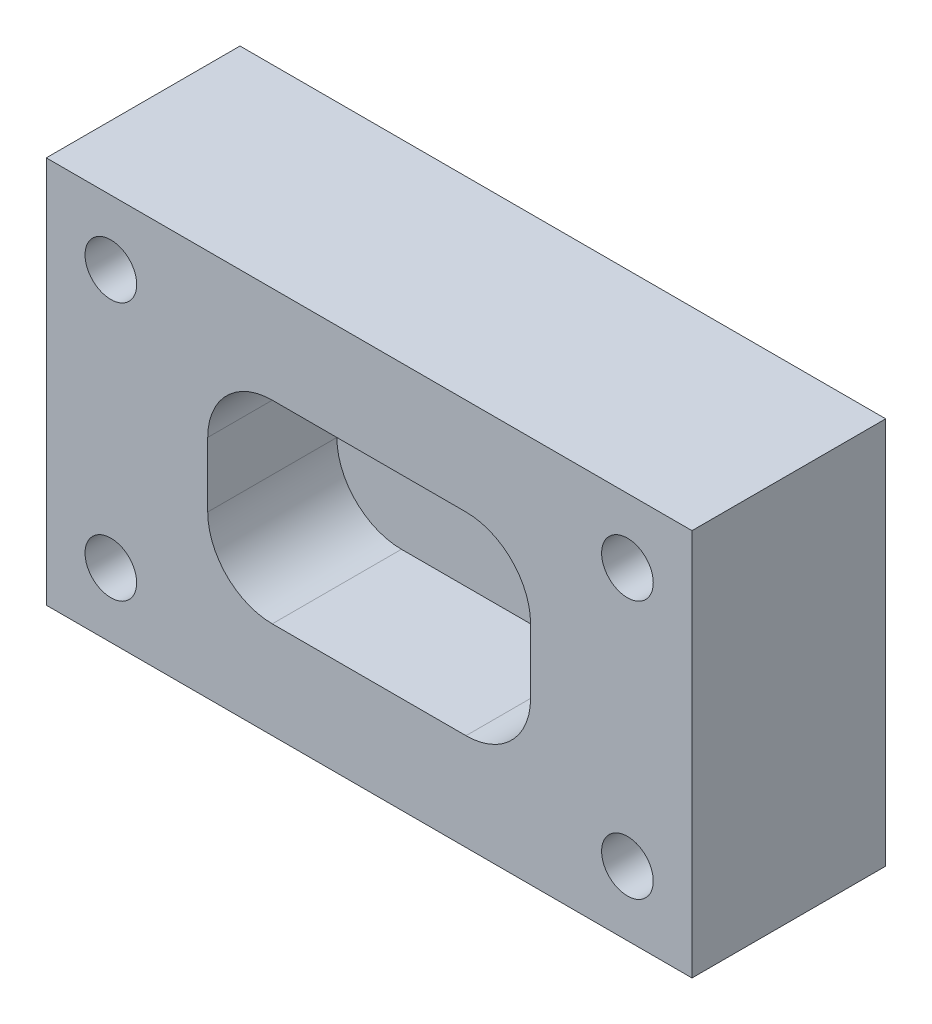
ISO-10303-21;
HEADER;
FILE_DESCRIPTION(('STEP AP214'),'2;1');
FILE_NAME('part.step','',(''),(''),'','','');
FILE_SCHEMA(('AUTOMOTIVE_DESIGN { 1 0 10303 214 1 1 1 1 }'));
ENDSEC;
DATA;
#1=APPLICATION_CONTEXT('core data for automotive mechanical design processes');
#2=APPLICATION_PROTOCOL_DEFINITION('international standard','automotive_design',2000,#1);
#3=PRODUCT_CONTEXT('',#1,'mechanical');
#4=PRODUCT('Part','Part','',(#3));
#5=PRODUCT_RELATED_PRODUCT_CATEGORY('part','',(#4));
#6=PRODUCT_DEFINITION_FORMATION('','',#4);
#7=PRODUCT_DEFINITION_CONTEXT('part definition',#1,'design');
#8=PRODUCT_DEFINITION('design','',#6,#7);
#9=PRODUCT_DEFINITION_SHAPE('','',#8);
#10=(LENGTH_UNIT() NAMED_UNIT(*) SI_UNIT(.MILLI.,.METRE.));
#11=(NAMED_UNIT(*) PLANE_ANGLE_UNIT() SI_UNIT($,.RADIAN.));
#12=(NAMED_UNIT(*) SI_UNIT($,.STERADIAN.) SOLID_ANGLE_UNIT());
#13=UNCERTAINTY_MEASURE_WITH_UNIT(LENGTH_MEASURE(1.E-05),#10,'distance_accuracy_value','');
#14=(GEOMETRIC_REPRESENTATION_CONTEXT(3) GLOBAL_UNCERTAINTY_ASSIGNED_CONTEXT((#13)) GLOBAL_UNIT_ASSIGNED_CONTEXT((#10,
#11,#12)) REPRESENTATION_CONTEXT('',''));
#15=CARTESIAN_POINT('',(0.,0.,0.));
#16=DIRECTION('',(0.,0.,1.));
#17=DIRECTION('',(1.,0.,0.));
#18=AXIS2_PLACEMENT_3D('',#15,#16,#17);
#19=CARTESIAN_POINT('',(50.,0.,-30.));
#20=DIRECTION('',(0.,-1.,0.));
#21=DIRECTION('',(0.,0.,-1.));
#22=AXIS2_PLACEMENT_3D('',#19,#20,#21);
#23=PLANE('',#22);
#24=DIRECTION('',(1.,0.,0.));
#25=VECTOR('',#24,1.);
#26=CARTESIAN_POINT('',(50.,0.,0.));
#27=LINE('',#26,#25);
#28=CARTESIAN_POINT('',(0.,0.,0.));
#29=VERTEX_POINT('',#28);
#30=CARTESIAN_POINT('',(100.,0.,0.));
#31=VERTEX_POINT('',#30);
#32=EDGE_CURVE('E231',#29,#31,#27,.T.);
#33=ORIENTED_EDGE('',*,*,#32,.F.);
#34=DIRECTION('',(0.,0.,1.));
#35=VECTOR('',#34,1.);
#36=CARTESIAN_POINT('',(0.,0.,-30.));
#37=LINE('',#36,#35);
#38=CARTESIAN_POINT('',(0.,0.,-30.));
#39=VERTEX_POINT('',#38);
#40=EDGE_CURVE('E11',#39,#29,#37,.T.);
#41=ORIENTED_EDGE('',*,*,#40,.F.);
#42=DIRECTION('',(1.,0.,0.));
#43=VECTOR('',#42,1.);
#44=CARTESIAN_POINT('',(50.,0.,-30.));
#45=LINE('',#44,#43);
#46=CARTESIAN_POINT('',(100.,0.,-30.));
#47=VERTEX_POINT('',#46);
#48=EDGE_CURVE('E211',#39,#47,#45,.T.);
#49=ORIENTED_EDGE('',*,*,#48,.T.);
#50=DIRECTION('',(0.,0.,1.));
#51=VECTOR('',#50,1.);
#52=CARTESIAN_POINT('',(100.,0.,-30.));
#53=LINE('',#52,#51);
#54=EDGE_CURVE('E35',#47,#31,#53,.T.);
#55=ORIENTED_EDGE('',*,*,#54,.T.);
#56=EDGE_LOOP('',(#33,#41,#49,#55));
#57=FACE_BOUND('',#56,.T.);
#58=ADVANCED_FACE('F31',(#57),#23,.T.);
#59=CARTESIAN_POINT('',(0.,-60.8497451198258,-30.));
#60=DIRECTION('',(1.,0.,0.));
#61=DIRECTION('',(0.,0.,-1.));
#62=AXIS2_PLACEMENT_3D('',#59,#60,#61);
#63=PLANE('',#62);
#64=DIRECTION('',(0.,1.,0.));
#65=VECTOR('',#64,1.);
#66=CARTESIAN_POINT('',(0.,-60.8497451198258,0.));
#67=LINE('',#66,#65);
#68=CARTESIAN_POINT('',(0.,60.,0.));
#69=VERTEX_POINT('',#68);
#70=EDGE_CURVE('E202',#29,#69,#67,.T.);
#71=ORIENTED_EDGE('',*,*,#70,.T.);
#72=DIRECTION('',(0.,0.,1.));
#73=VECTOR('',#72,1.);
#74=CARTESIAN_POINT('',(0.,60.,-30.));
#75=LINE('',#74,#73);
#76=CARTESIAN_POINT('',(0.,60.,-30.));
#77=VERTEX_POINT('',#76);
#78=EDGE_CURVE('E40',#77,#69,#75,.T.);
#79=ORIENTED_EDGE('',*,*,#78,.F.);
#80=DIRECTION('',(0.,1.,0.));
#81=VECTOR('',#80,1.);
#82=CARTESIAN_POINT('',(0.,-60.8497451198258,-30.));
#83=LINE('',#82,#81);
#84=EDGE_CURVE('E217',#39,#77,#83,.T.);
#85=ORIENTED_EDGE('',*,*,#84,.F.);
#86=ORIENTED_EDGE('',*,*,#40,.T.);
#87=EDGE_LOOP('',(#71,#79,#85,#86));
#88=FACE_BOUND('',#87,.T.);
#89=ADVANCED_FACE('F249',(#88),#63,.F.);
#90=CARTESIAN_POINT('',(50.,60.,-30.));
#91=DIRECTION('',(0.,-1.,0.));
#92=DIRECTION('',(0.,0.,-1.));
#93=AXIS2_PLACEMENT_3D('',#90,#91,#92);
#94=PLANE('',#93);
#95=DIRECTION('',(1.,0.,0.));
#96=VECTOR('',#95,1.);
#97=CARTESIAN_POINT('',(50.,60.,0.));
#98=LINE('',#97,#96);
#99=CARTESIAN_POINT('',(100.,60.,0.));
#100=VERTEX_POINT('',#99);
#101=EDGE_CURVE('E237',#69,#100,#98,.T.);
#102=ORIENTED_EDGE('',*,*,#101,.T.);
#103=DIRECTION('',(0.,0.,1.));
#104=VECTOR('',#103,1.);
#105=CARTESIAN_POINT('',(100.,60.,-30.));
#106=LINE('',#105,#104);
#107=CARTESIAN_POINT('',(100.,60.,-30.));
#108=VERTEX_POINT('',#107);
#109=EDGE_CURVE('E242',#108,#100,#106,.T.);
#110=ORIENTED_EDGE('',*,*,#109,.F.);
#111=DIRECTION('',(1.,0.,0.));
#112=VECTOR('',#111,1.);
#113=CARTESIAN_POINT('',(50.,60.,-30.));
#114=LINE('',#113,#112);
#115=EDGE_CURVE('E215',#77,#108,#114,.T.);
#116=ORIENTED_EDGE('',*,*,#115,.F.);
#117=ORIENTED_EDGE('',*,*,#78,.T.);
#118=EDGE_LOOP('',(#102,#110,#116,#117));
#119=FACE_BOUND('',#118,.T.);
#120=ADVANCED_FACE('F251',(#119),#94,.F.);
#121=CARTESIAN_POINT('',(90.,50.,-30.));
#122=DIRECTION('',(0.,0.,1.));
#123=DIRECTION('',(1.,0.,0.));
#124=AXIS2_PLACEMENT_3D('',#121,#122,#123);
#125=CYLINDRICAL_SURFACE('',#124,4.00000000000001);
#126=CARTESIAN_POINT('',(90.,50.,-30.));
#127=DIRECTION('',(0.,0.,1.));
#128=DIRECTION('',(1.,0.,0.));
#129=AXIS2_PLACEMENT_3D('',#126,#127,#128);
#130=CIRCLE('',#129,4.00000000000001);
#131=CARTESIAN_POINT('',(94.,50.,-30.));
#132=VERTEX_POINT('',#131);
#133=EDGE_CURVE('E208',#132,#132,#130,.T.);
#134=ORIENTED_EDGE('',*,*,#133,.F.);
#135=EDGE_LOOP('',(#134));
#136=FACE_BOUND('',#135,.T.);
#137=CARTESIAN_POINT('',(90.,50.,0.));
#138=DIRECTION('',(0.,0.,1.));
#139=DIRECTION('',(1.,0.,0.));
#140=AXIS2_PLACEMENT_3D('',#137,#138,#139);
#141=CIRCLE('',#140,4.00000000000001);
#142=CARTESIAN_POINT('',(94.,50.,0.));
#143=VERTEX_POINT('',#142);
#144=EDGE_CURVE('E228',#143,#143,#141,.T.);
#145=ORIENTED_EDGE('',*,*,#144,.T.);
#146=EDGE_LOOP('',(#145));
#147=FACE_BOUND('',#146,.T.);
#148=ADVANCED_FACE('F274',(#136,#147),#125,.F.);
#149=CARTESIAN_POINT('',(10.,50.,-30.));
#150=DIRECTION('',(0.,0.,1.));
#151=DIRECTION('',(1.,0.,0.));
#152=AXIS2_PLACEMENT_3D('',#149,#150,#151);
#153=CYLINDRICAL_SURFACE('',#152,4.00000000000001);
#154=CARTESIAN_POINT('',(10.,50.,-30.));
#155=DIRECTION('',(0.,0.,1.));
#156=DIRECTION('',(1.,0.,0.));
#157=AXIS2_PLACEMENT_3D('',#154,#155,#156);
#158=CIRCLE('',#157,4.00000000000001);
#159=CARTESIAN_POINT('',(14.,50.,-30.));
#160=VERTEX_POINT('',#159);
#161=EDGE_CURVE('E205',#160,#160,#158,.T.);
#162=ORIENTED_EDGE('',*,*,#161,.F.);
#163=EDGE_LOOP('',(#162));
#164=FACE_BOUND('',#163,.T.);
#165=CARTESIAN_POINT('',(10.,50.,0.));
#166=DIRECTION('',(0.,0.,1.));
#167=DIRECTION('',(1.,0.,0.));
#168=AXIS2_PLACEMENT_3D('',#165,#166,#167);
#169=CIRCLE('',#168,4.00000000000001);
#170=CARTESIAN_POINT('',(14.,50.,0.));
#171=VERTEX_POINT('',#170);
#172=EDGE_CURVE('E225',#171,#171,#169,.T.);
#173=ORIENTED_EDGE('',*,*,#172,.T.);
#174=EDGE_LOOP('',(#173));
#175=FACE_BOUND('',#174,.T.);
#176=ADVANCED_FACE('F277',(#164,#175),#153,.F.);
#177=CARTESIAN_POINT('',(9.99999999999999,10.,-30.));
#178=DIRECTION('',(0.,0.,1.));
#179=DIRECTION('',(1.,0.,0.));
#180=AXIS2_PLACEMENT_3D('',#177,#178,#179);
#181=CYLINDRICAL_SURFACE('',#180,4.);
#182=CARTESIAN_POINT('',(9.99999999999999,10.,-30.));
#183=DIRECTION('',(0.,0.,1.));
#184=DIRECTION('',(1.,0.,0.));
#185=AXIS2_PLACEMENT_3D('',#182,#183,#184);
#186=CIRCLE('',#185,4.);
#187=CARTESIAN_POINT('',(14.,10.,-30.));
#188=VERTEX_POINT('',#187);
#189=EDGE_CURVE('E201',#188,#188,#186,.T.);
#190=ORIENTED_EDGE('',*,*,#189,.F.);
#191=EDGE_LOOP('',(#190));
#192=FACE_BOUND('',#191,.T.);
#193=CARTESIAN_POINT('',(9.99999999999999,10.,0.));
#194=DIRECTION('',(0.,0.,1.));
#195=DIRECTION('',(1.,0.,0.));
#196=AXIS2_PLACEMENT_3D('',#193,#194,#195);
#197=CIRCLE('',#196,4.);
#198=CARTESIAN_POINT('',(14.,10.,0.));
#199=VERTEX_POINT('',#198);
#200=EDGE_CURVE('E222',#199,#199,#197,.T.);
#201=ORIENTED_EDGE('',*,*,#200,.T.);
#202=EDGE_LOOP('',(#201));
#203=FACE_BOUND('',#202,.T.);
#204=ADVANCED_FACE('F280',(#192,#203),#181,.F.);
#205=CARTESIAN_POINT('',(90.,10.,-30.));
#206=DIRECTION('',(0.,0.,1.));
#207=DIRECTION('',(1.,0.,0.));
#208=AXIS2_PLACEMENT_3D('',#205,#206,#207);
#209=CYLINDRICAL_SURFACE('',#208,4.00000000000001);
#210=CARTESIAN_POINT('',(90.,10.,-30.));
#211=DIRECTION('',(0.,0.,1.));
#212=DIRECTION('',(1.,0.,0.));
#213=AXIS2_PLACEMENT_3D('',#210,#211,#212);
#214=CIRCLE('',#213,4.00000000000001);
#215=CARTESIAN_POINT('',(94.,10.,-30.));
#216=VERTEX_POINT('',#215);
#217=EDGE_CURVE('E198',#216,#216,#214,.T.);
#218=ORIENTED_EDGE('',*,*,#217,.F.);
#219=EDGE_LOOP('',(#218));
#220=FACE_BOUND('',#219,.T.);
#221=CARTESIAN_POINT('',(90.,10.,0.));
#222=DIRECTION('',(0.,0.,1.));
#223=DIRECTION('',(1.,0.,0.));
#224=AXIS2_PLACEMENT_3D('',#221,#222,#223);
#225=CIRCLE('',#224,4.00000000000001);
#226=CARTESIAN_POINT('',(94.,10.,0.));
#227=VERTEX_POINT('',#226);
#228=EDGE_CURVE('E186',#227,#227,#225,.T.);
#229=ORIENTED_EDGE('',*,*,#228,.T.);
#230=EDGE_LOOP('',(#229));
#231=FACE_BOUND('',#230,.T.);
#232=ADVANCED_FACE('F33',(#220,#231),#209,.F.);
#233=CARTESIAN_POINT('',(100.,-60.8497451198258,-30.));
#234=DIRECTION('',(1.,0.,0.));
#235=DIRECTION('',(0.,0.,-1.));
#236=AXIS2_PLACEMENT_3D('',#233,#234,#235);
#237=PLANE('',#236);
#238=DIRECTION('',(0.,1.,0.));
#239=VECTOR('',#238,1.);
#240=CARTESIAN_POINT('',(100.,-60.8497451198258,0.));
#241=LINE('',#240,#239);
#242=EDGE_CURVE('E234',#31,#100,#241,.T.);
#243=ORIENTED_EDGE('',*,*,#242,.F.);
#244=ORIENTED_EDGE('',*,*,#54,.F.);
#245=DIRECTION('',(0.,1.,0.));
#246=VECTOR('',#245,1.);
#247=CARTESIAN_POINT('',(100.,-60.8497451198258,-30.));
#248=LINE('',#247,#246);
#249=EDGE_CURVE('E213',#47,#108,#248,.T.);
#250=ORIENTED_EDGE('',*,*,#249,.T.);
#251=ORIENTED_EDGE('',*,*,#109,.T.);
#252=EDGE_LOOP('',(#243,#244,#250,#251));
#253=FACE_BOUND('',#252,.T.);
#254=ADVANCED_FACE('F245',(#253),#237,.T.);
#255=CARTESIAN_POINT('',(50.,-60.8497451198258,-30.));
#256=DIRECTION('',(0.,0.,1.));
#257=DIRECTION('',(1.,0.,0.));
#258=AXIS2_PLACEMENT_3D('',#255,#256,#257);
#259=PLANE('',#258);
#260=ORIENTED_EDGE('',*,*,#217,.T.);
#261=EDGE_LOOP('',(#260));
#262=FACE_BOUND('',#261,.T.);
#263=ORIENTED_EDGE('',*,*,#189,.T.);
#264=EDGE_LOOP('',(#263));
#265=FACE_BOUND('',#264,.T.);
#266=ORIENTED_EDGE('',*,*,#161,.T.);
#267=EDGE_LOOP('',(#266));
#268=FACE_BOUND('',#267,.T.);
#269=ORIENTED_EDGE('',*,*,#133,.T.);
#270=EDGE_LOOP('',(#269));
#271=FACE_BOUND('',#270,.T.);
#272=ORIENTED_EDGE('',*,*,#48,.F.);
#273=ORIENTED_EDGE('',*,*,#84,.T.);
#274=ORIENTED_EDGE('',*,*,#115,.T.);
#275=ORIENTED_EDGE('',*,*,#249,.F.);
#276=EDGE_LOOP('',(#272,#273,#274,#275));
#277=FACE_BOUND('',#276,.T.);
#278=ADVANCED_FACE('F253',(#262,#265,#268,#271,#277),#259,.F.);
#279=CARTESIAN_POINT('',(50.,-60.8497451198258,0.));
#280=DIRECTION('',(0.,0.,1.));
#281=DIRECTION('',(1.,0.,0.));
#282=AXIS2_PLACEMENT_3D('',#279,#280,#281);
#283=PLANE('',#282);
#284=DIRECTION('',(0.,-1.,0.));
#285=VECTOR('',#284,1.);
#286=CARTESIAN_POINT('',(25.,-60.8497451198258,0.));
#287=LINE('',#286,#285);
#288=CARTESIAN_POINT('',(25.,34.9999999999999,0.));
#289=VERTEX_POINT('',#288);
#290=CARTESIAN_POINT('',(25.,25.0000000000001,0.));
#291=VERTEX_POINT('',#290);
#292=EDGE_CURVE('E48',#289,#291,#287,.T.);
#293=ORIENTED_EDGE('',*,*,#292,.F.);
#294=CARTESIAN_POINT('',(35.,35.,0.));
#295=DIRECTION('',(0.,0.,1.));
#296=DIRECTION('',(1.,0.,0.));
#297=AXIS2_PLACEMENT_3D('',#294,#295,#296);
#298=CIRCLE('',#297,10.);
#299=CARTESIAN_POINT('',(35.0000000000001,45.,0.));
#300=VERTEX_POINT('',#299);
#301=EDGE_CURVE('E149',#300,#289,#298,.T.);
#302=ORIENTED_EDGE('',*,*,#301,.F.);
#303=DIRECTION('',(1.,0.,0.));
#304=VECTOR('',#303,1.);
#305=CARTESIAN_POINT('',(50.,45.,0.));
#306=LINE('',#305,#304);
#307=CARTESIAN_POINT('',(64.9999999999999,45.,0.));
#308=VERTEX_POINT('',#307);
#309=EDGE_CURVE('E152',#300,#308,#306,.T.);
#310=ORIENTED_EDGE('',*,*,#309,.T.);
#311=CARTESIAN_POINT('',(65.,35.,0.));
#312=DIRECTION('',(0.,0.,1.));
#313=DIRECTION('',(1.,0.,0.));
#314=AXIS2_PLACEMENT_3D('',#311,#312,#313);
#315=CIRCLE('',#314,10.);
#316=CARTESIAN_POINT('',(75.,34.9999999999999,0.));
#317=VERTEX_POINT('',#316);
#318=EDGE_CURVE('E179',#317,#308,#315,.T.);
#319=ORIENTED_EDGE('',*,*,#318,.F.);
#320=DIRECTION('',(0.,-1.,0.));
#321=VECTOR('',#320,1.);
#322=CARTESIAN_POINT('',(75.,-60.8497451198258,0.));
#323=LINE('',#322,#321);
#324=CARTESIAN_POINT('',(75.,25.0000000000001,0.));
#325=VERTEX_POINT('',#324);
#326=EDGE_CURVE('E176',#317,#325,#323,.T.);
#327=ORIENTED_EDGE('',*,*,#326,.T.);
#328=CARTESIAN_POINT('',(65.,25.,0.));
#329=DIRECTION('',(0.,0.,1.));
#330=DIRECTION('',(1.,0.,0.));
#331=AXIS2_PLACEMENT_3D('',#328,#329,#330);
#332=CIRCLE('',#331,10.);
#333=CARTESIAN_POINT('',(64.9999999999999,15.,0.));
#334=VERTEX_POINT('',#333);
#335=EDGE_CURVE('E173',#334,#325,#332,.T.);
#336=ORIENTED_EDGE('',*,*,#335,.F.);
#337=DIRECTION('',(1.,0.,0.));
#338=VECTOR('',#337,1.);
#339=CARTESIAN_POINT('',(50.,15.,0.));
#340=LINE('',#339,#338);
#341=CARTESIAN_POINT('',(35.0000000000001,15.,0.));
#342=VERTEX_POINT('',#341);
#343=EDGE_CURVE('E170',#342,#334,#340,.T.);
#344=ORIENTED_EDGE('',*,*,#343,.F.);
#345=CARTESIAN_POINT('',(35.,25.,0.));
#346=DIRECTION('',(0.,0.,1.));
#347=DIRECTION('',(1.,0.,0.));
#348=AXIS2_PLACEMENT_3D('',#345,#346,#347);
#349=CIRCLE('',#348,10.);
#350=EDGE_CURVE('E168',#291,#342,#349,.T.);
#351=ORIENTED_EDGE('',*,*,#350,.F.);
#352=EDGE_LOOP('',(#293,#302,#310,#319,#327,#336,#344,#351));
#353=FACE_BOUND('',#352,.T.);
#354=ORIENTED_EDGE('',*,*,#228,.F.);
#355=EDGE_LOOP('',(#354));
#356=FACE_BOUND('',#355,.T.);
#357=ORIENTED_EDGE('',*,*,#200,.F.);
#358=EDGE_LOOP('',(#357));
#359=FACE_BOUND('',#358,.T.);
#360=ORIENTED_EDGE('',*,*,#172,.F.);
#361=EDGE_LOOP('',(#360));
#362=FACE_BOUND('',#361,.T.);
#363=ORIENTED_EDGE('',*,*,#144,.F.);
#364=EDGE_LOOP('',(#363));
#365=FACE_BOUND('',#364,.T.);
#366=ORIENTED_EDGE('',*,*,#32,.T.);
#367=ORIENTED_EDGE('',*,*,#242,.T.);
#368=ORIENTED_EDGE('',*,*,#101,.F.);
#369=ORIENTED_EDGE('',*,*,#70,.F.);
#370=EDGE_LOOP('',(#366,#367,#368,#369));
#371=FACE_BOUND('',#370,.T.);
#372=ADVANCED_FACE('F247',(#353,#356,#359,#362,#365,#371),#283,.T.);
#373=CARTESIAN_POINT('',(25.,-60.8497451198258,-20.));
#374=DIRECTION('',(-1.,0.,0.));
#375=DIRECTION('',(0.,0.,1.));
#376=AXIS2_PLACEMENT_3D('',#373,#374,#375);
#377=PLANE('',#376);
#378=ORIENTED_EDGE('',*,*,#292,.T.);
#379=DIRECTION('',(0.,0.,1.));
#380=VECTOR('',#379,1.);
#381=CARTESIAN_POINT('',(25.,25.0000000000001,-20.));
#382=LINE('',#381,#380);
#383=CARTESIAN_POINT('',(25.,25.0000000000001,-20.));
#384=VERTEX_POINT('',#383);
#385=EDGE_CURVE('E126',#384,#291,#382,.T.);
#386=ORIENTED_EDGE('',*,*,#385,.F.);
#387=DIRECTION('',(0.,-1.,0.));
#388=VECTOR('',#387,1.);
#389=CARTESIAN_POINT('',(25.,-60.8497451198258,-20.));
#390=LINE('',#389,#388);
#391=CARTESIAN_POINT('',(25.,34.9999999999999,-20.));
#392=VERTEX_POINT('',#391);
#393=EDGE_CURVE('E130',#392,#384,#390,.T.);
#394=ORIENTED_EDGE('',*,*,#393,.F.);
#395=DIRECTION('',(0.,0.,1.));
#396=VECTOR('',#395,1.);
#397=CARTESIAN_POINT('',(25.,34.9999999999999,-20.));
#398=LINE('',#397,#396);
#399=EDGE_CURVE('E184',#392,#289,#398,.T.);
#400=ORIENTED_EDGE('',*,*,#399,.T.);
#401=EDGE_LOOP('',(#378,#386,#394,#400));
#402=FACE_BOUND('',#401,.T.);
#403=ADVANCED_FACE('F128',(#402),#377,.F.);
#404=CARTESIAN_POINT('',(35.,35.,-20.));
#405=DIRECTION('',(0.,0.,1.));
#406=DIRECTION('',(1.,0.,0.));
#407=AXIS2_PLACEMENT_3D('',#404,#405,#406);
#408=CYLINDRICAL_SURFACE('',#407,10.);
#409=ORIENTED_EDGE('',*,*,#301,.T.);
#410=ORIENTED_EDGE('',*,*,#399,.F.);
#411=CARTESIAN_POINT('',(35.,35.,-20.));
#412=DIRECTION('',(0.,0.,1.));
#413=DIRECTION('',(1.,0.,0.));
#414=AXIS2_PLACEMENT_3D('',#411,#412,#413);
#415=CIRCLE('',#414,10.);
#416=CARTESIAN_POINT('',(35.0000000000001,45.,-20.));
#417=VERTEX_POINT('',#416);
#418=EDGE_CURVE('E136',#417,#392,#415,.T.);
#419=ORIENTED_EDGE('',*,*,#418,.F.);
#420=DIRECTION('',(0.,0.,1.));
#421=VECTOR('',#420,1.);
#422=CARTESIAN_POINT('',(35.0000000000001,45.,-20.));
#423=LINE('',#422,#421);
#424=EDGE_CURVE('E187',#417,#300,#423,.T.);
#425=ORIENTED_EDGE('',*,*,#424,.T.);
#426=EDGE_LOOP('',(#409,#410,#419,#425));
#427=FACE_BOUND('',#426,.T.);
#428=ADVANCED_FACE('F331',(#427),#408,.F.);
#429=CARTESIAN_POINT('',(50.,45.,-20.));
#430=DIRECTION('',(0.,-1.,0.));
#431=DIRECTION('',(1.,0.,0.));
#432=AXIS2_PLACEMENT_3D('',#429,#430,#431);
#433=PLANE('',#432);
#434=ORIENTED_EDGE('',*,*,#309,.F.);
#435=ORIENTED_EDGE('',*,*,#424,.F.);
#436=DIRECTION('',(1.,0.,0.));
#437=VECTOR('',#436,1.);
#438=CARTESIAN_POINT('',(50.,45.,-20.));
#439=LINE('',#438,#437);
#440=CARTESIAN_POINT('',(64.9999999999999,45.,-20.));
#441=VERTEX_POINT('',#440);
#442=EDGE_CURVE('E164',#417,#441,#439,.T.);
#443=ORIENTED_EDGE('',*,*,#442,.T.);
#444=DIRECTION('',(0.,0.,1.));
#445=VECTOR('',#444,1.);
#446=CARTESIAN_POINT('',(64.9999999999999,45.,-20.));
#447=LINE('',#446,#445);
#448=EDGE_CURVE('E189',#441,#308,#447,.T.);
#449=ORIENTED_EDGE('',*,*,#448,.T.);
#450=EDGE_LOOP('',(#434,#435,#443,#449));
#451=FACE_BOUND('',#450,.T.);
#452=ADVANCED_FACE('F339',(#451),#433,.T.);
#453=CARTESIAN_POINT('',(65.,35.,-20.));
#454=DIRECTION('',(0.,0.,1.));
#455=DIRECTION('',(1.,0.,0.));
#456=AXIS2_PLACEMENT_3D('',#453,#454,#455);
#457=CYLINDRICAL_SURFACE('',#456,10.);
#458=ORIENTED_EDGE('',*,*,#318,.T.);
#459=ORIENTED_EDGE('',*,*,#448,.F.);
#460=CARTESIAN_POINT('',(65.,35.,-20.));
#461=DIRECTION('',(0.,0.,1.));
#462=DIRECTION('',(1.,0.,0.));
#463=AXIS2_PLACEMENT_3D('',#460,#461,#462);
#464=CIRCLE('',#463,10.);
#465=CARTESIAN_POINT('',(75.,34.9999999999999,-20.));
#466=VERTEX_POINT('',#465);
#467=EDGE_CURVE('E161',#466,#441,#464,.T.);
#468=ORIENTED_EDGE('',*,*,#467,.F.);
#469=DIRECTION('',(0.,0.,1.));
#470=VECTOR('',#469,1.);
#471=CARTESIAN_POINT('',(75.,34.9999999999999,-20.));
#472=LINE('',#471,#470);
#473=EDGE_CURVE('E191',#466,#317,#472,.T.);
#474=ORIENTED_EDGE('',*,*,#473,.T.);
#475=EDGE_LOOP('',(#458,#459,#468,#474));
#476=FACE_BOUND('',#475,.T.);
#477=ADVANCED_FACE('F349',(#476),#457,.F.);
#478=CARTESIAN_POINT('',(75.,-60.8497451198258,-20.));
#479=DIRECTION('',(-1.,0.,0.));
#480=DIRECTION('',(0.,0.,1.));
#481=AXIS2_PLACEMENT_3D('',#478,#479,#480);
#482=PLANE('',#481);
#483=ORIENTED_EDGE('',*,*,#326,.F.);
#484=ORIENTED_EDGE('',*,*,#473,.F.);
#485=DIRECTION('',(0.,-1.,0.));
#486=VECTOR('',#485,1.);
#487=CARTESIAN_POINT('',(75.,-60.8497451198258,-20.));
#488=LINE('',#487,#486);
#489=CARTESIAN_POINT('',(75.,25.0000000000001,-20.));
#490=VERTEX_POINT('',#489);
#491=EDGE_CURVE('E159',#466,#490,#488,.T.);
#492=ORIENTED_EDGE('',*,*,#491,.T.);
#493=DIRECTION('',(0.,0.,1.));
#494=VECTOR('',#493,1.);
#495=CARTESIAN_POINT('',(75.,25.0000000000001,-20.));
#496=LINE('',#495,#494);
#497=EDGE_CURVE('E193',#490,#325,#496,.T.);
#498=ORIENTED_EDGE('',*,*,#497,.T.);
#499=EDGE_LOOP('',(#483,#484,#492,#498));
#500=FACE_BOUND('',#499,.T.);
#501=ADVANCED_FACE('F359',(#500),#482,.T.);
#502=CARTESIAN_POINT('',(65.,25.,-20.));
#503=DIRECTION('',(0.,0.,1.));
#504=DIRECTION('',(1.,0.,0.));
#505=AXIS2_PLACEMENT_3D('',#502,#503,#504);
#506=CYLINDRICAL_SURFACE('',#505,10.);
#507=ORIENTED_EDGE('',*,*,#335,.T.);
#508=ORIENTED_EDGE('',*,*,#497,.F.);
#509=CARTESIAN_POINT('',(65.,25.,-20.));
#510=DIRECTION('',(0.,0.,1.));
#511=DIRECTION('',(1.,0.,0.));
#512=AXIS2_PLACEMENT_3D('',#509,#510,#511);
#513=CIRCLE('',#512,10.);
#514=CARTESIAN_POINT('',(64.9999999999999,15.,-20.));
#515=VERTEX_POINT('',#514);
#516=EDGE_CURVE('E156',#515,#490,#513,.T.);
#517=ORIENTED_EDGE('',*,*,#516,.F.);
#518=DIRECTION('',(0.,0.,1.));
#519=VECTOR('',#518,1.);
#520=CARTESIAN_POINT('',(64.9999999999999,15.,-20.));
#521=LINE('',#520,#519);
#522=EDGE_CURVE('E195',#515,#334,#521,.T.);
#523=ORIENTED_EDGE('',*,*,#522,.T.);
#524=EDGE_LOOP('',(#507,#508,#517,#523));
#525=FACE_BOUND('',#524,.T.);
#526=ADVANCED_FACE('F369',(#525),#506,.F.);
#527=CARTESIAN_POINT('',(50.,15.,-20.));
#528=DIRECTION('',(0.,-1.,0.));
#529=DIRECTION('',(0.,0.,-1.));
#530=AXIS2_PLACEMENT_3D('',#527,#528,#529);
#531=PLANE('',#530);
#532=ORIENTED_EDGE('',*,*,#343,.T.);
#533=ORIENTED_EDGE('',*,*,#522,.F.);
#534=DIRECTION('',(1.,0.,0.));
#535=VECTOR('',#534,1.);
#536=CARTESIAN_POINT('',(50.,15.,-20.));
#537=LINE('',#536,#535);
#538=CARTESIAN_POINT('',(35.0000000000001,15.,-20.));
#539=VERTEX_POINT('',#538);
#540=EDGE_CURVE('E144',#539,#515,#537,.T.);
#541=ORIENTED_EDGE('',*,*,#540,.F.);
#542=DIRECTION('',(0.,0.,1.));
#543=VECTOR('',#542,1.);
#544=CARTESIAN_POINT('',(35.0000000000001,15.,-20.));
#545=LINE('',#544,#543);
#546=EDGE_CURVE('E135',#539,#342,#545,.T.);
#547=ORIENTED_EDGE('',*,*,#546,.T.);
#548=EDGE_LOOP('',(#532,#533,#541,#547));
#549=FACE_BOUND('',#548,.T.);
#550=ADVANCED_FACE('F379',(#549),#531,.F.);
#551=CARTESIAN_POINT('',(35.,25.,-20.));
#552=DIRECTION('',(0.,0.,1.));
#553=DIRECTION('',(1.,0.,0.));
#554=AXIS2_PLACEMENT_3D('',#551,#552,#553);
#555=CYLINDRICAL_SURFACE('',#554,10.);
#556=ORIENTED_EDGE('',*,*,#350,.T.);
#557=ORIENTED_EDGE('',*,*,#546,.F.);
#558=CARTESIAN_POINT('',(35.,25.,-20.));
#559=DIRECTION('',(0.,0.,1.));
#560=DIRECTION('',(1.,0.,0.));
#561=AXIS2_PLACEMENT_3D('',#558,#559,#560);
#562=CIRCLE('',#561,10.);
#563=EDGE_CURVE('E139',#384,#539,#562,.T.);
#564=ORIENTED_EDGE('',*,*,#563,.F.);
#565=ORIENTED_EDGE('',*,*,#385,.T.);
#566=EDGE_LOOP('',(#556,#557,#564,#565));
#567=FACE_BOUND('',#566,.T.);
#568=ADVANCED_FACE('F140',(#567),#555,.F.);
#569=CARTESIAN_POINT('',(50.,-60.8497451198258,-20.));
#570=DIRECTION('',(0.,0.,1.));
#571=DIRECTION('',(1.,0.,0.));
#572=AXIS2_PLACEMENT_3D('',#569,#570,#571);
#573=PLANE('',#572);
#574=ORIENTED_EDGE('',*,*,#393,.T.);
#575=ORIENTED_EDGE('',*,*,#563,.T.);
#576=ORIENTED_EDGE('',*,*,#540,.T.);
#577=ORIENTED_EDGE('',*,*,#516,.T.);
#578=ORIENTED_EDGE('',*,*,#491,.F.);
#579=ORIENTED_EDGE('',*,*,#467,.T.);
#580=ORIENTED_EDGE('',*,*,#442,.F.);
#581=ORIENTED_EDGE('',*,*,#418,.T.);
#582=EDGE_LOOP('',(#574,#575,#576,#577,#578,#579,#580,#581));
#583=FACE_BOUND('',#582,.T.);
#584=ADVANCED_FACE('F146',(#583),#573,.T.);
#585=CLOSED_SHELL('',(#58,#89,#120,#148,#176,#204,#232,#254,#278,#372,#403,#428,#452,#477,#501,
#526,#550,#568,#584));
#586=MANIFOLD_SOLID_BREP('B2',#585);
#587=ADVANCED_BREP_SHAPE_REPRESENTATION('',(#18,#586),#14);
#588=SHAPE_DEFINITION_REPRESENTATION(#9,#587);
ENDSEC;
END-ISO-10303-21;
